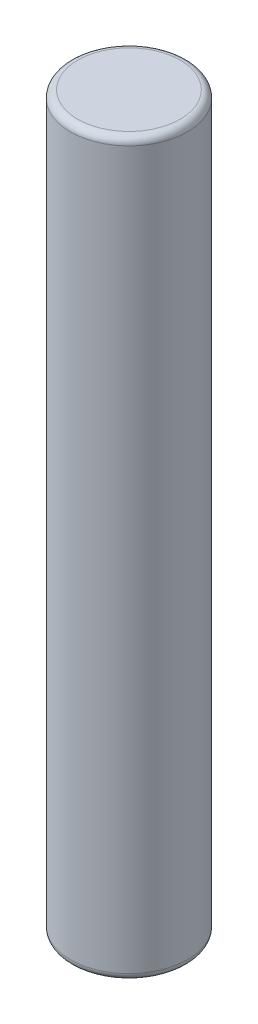
ISO-10303-21;
HEADER;
FILE_DESCRIPTION(('STEP AP214'),'2;1');
FILE_NAME('part.step','',(''),(''),'','','');
FILE_SCHEMA(('AUTOMOTIVE_DESIGN { 1 0 10303 214 1 1 1 1 }'));
ENDSEC;
DATA;
#1=APPLICATION_CONTEXT('core data for automotive mechanical design processes');
#2=APPLICATION_PROTOCOL_DEFINITION('international standard','automotive_design',2000,#1);
#3=PRODUCT_CONTEXT('',#1,'mechanical');
#4=PRODUCT('Part','Part','',(#3));
#5=PRODUCT_RELATED_PRODUCT_CATEGORY('part','',(#4));
#6=PRODUCT_DEFINITION_FORMATION('','',#4);
#7=PRODUCT_DEFINITION_CONTEXT('part definition',#1,'design');
#8=PRODUCT_DEFINITION('design','',#6,#7);
#9=PRODUCT_DEFINITION_SHAPE('','',#8);
#10=(LENGTH_UNIT() NAMED_UNIT(*) SI_UNIT(.MILLI.,.METRE.));
#11=(NAMED_UNIT(*) PLANE_ANGLE_UNIT() SI_UNIT($,.RADIAN.));
#12=(NAMED_UNIT(*) SI_UNIT($,.STERADIAN.) SOLID_ANGLE_UNIT());
#13=UNCERTAINTY_MEASURE_WITH_UNIT(LENGTH_MEASURE(1.E-05),#10,'distance_accuracy_value','');
#14=(GEOMETRIC_REPRESENTATION_CONTEXT(3) GLOBAL_UNCERTAINTY_ASSIGNED_CONTEXT((#13)) GLOBAL_UNIT_ASSIGNED_CONTEXT((#10,
#11,#12)) REPRESENTATION_CONTEXT('',''));
#15=CARTESIAN_POINT('',(0.,0.,0.));
#16=DIRECTION('',(0.,0.,1.));
#17=DIRECTION('',(1.,0.,0.));
#18=AXIS2_PLACEMENT_3D('',#15,#16,#17);
#19=CARTESIAN_POINT('',(0.,50.,0.));
#20=DIRECTION('',(0.,-1.,0.));
#21=DIRECTION('',(0.,0.,-1.));
#22=AXIS2_PLACEMENT_3D('',#19,#20,#21);
#23=CYLINDRICAL_SURFACE('',#22,4.);
#24=CARTESIAN_POINT('',(0.,49.5,0.));
#25=DIRECTION('',(0.,1.,0.));
#26=DIRECTION('',(0.,0.,1.));
#27=AXIS2_PLACEMENT_3D('',#24,#25,#26);
#28=CIRCLE('',#27,4.);
#29=CARTESIAN_POINT('',(0.,49.5,4.));
#30=VERTEX_POINT('',#29);
#31=EDGE_CURVE('E41',#30,#30,#28,.F.);
#32=ORIENTED_EDGE('',*,*,#31,.T.);
#33=EDGE_LOOP('',(#32));
#34=FACE_BOUND('',#33,.T.);
#35=CARTESIAN_POINT('',(0.,0.5,0.));
#36=DIRECTION('',(0.,1.,0.));
#37=DIRECTION('',(0.,0.,1.));
#38=AXIS2_PLACEMENT_3D('',#35,#36,#37);
#39=CIRCLE('',#38,4.);
#40=CARTESIAN_POINT('',(0.,0.5,4.));
#41=VERTEX_POINT('',#40);
#42=EDGE_CURVE('E46',#41,#41,#39,.T.);
#43=ORIENTED_EDGE('',*,*,#42,.T.);
#44=EDGE_LOOP('',(#43));
#45=FACE_BOUND('',#44,.T.);
#46=ADVANCED_FACE('F34',(#34,#45),#23,.T.);
#47=CARTESIAN_POINT('',(0.,50.,0.));
#48=DIRECTION('',(0.,1.,0.));
#49=DIRECTION('',(0.,0.,1.));
#50=AXIS2_PLACEMENT_3D('',#47,#48,#49);
#51=PLANE('',#50);
#52=CARTESIAN_POINT('',(0.,50.,0.));
#53=DIRECTION('',(0.,1.,0.));
#54=DIRECTION('',(0.,0.,1.));
#55=AXIS2_PLACEMENT_3D('',#52,#53,#54);
#56=CIRCLE('',#55,3.5);
#57=CARTESIAN_POINT('',(0.,50.,3.5));
#58=VERTEX_POINT('',#57);
#59=EDGE_CURVE('E51',#58,#58,#56,.T.);
#60=ORIENTED_EDGE('',*,*,#59,.T.);
#61=EDGE_LOOP('',(#60));
#62=FACE_BOUND('',#61,.T.);
#63=ADVANCED_FACE('F57',(#62),#51,.T.);
#64=CARTESIAN_POINT('',(0.,0.,0.));
#65=DIRECTION('',(0.,1.,0.));
#66=DIRECTION('',(0.,0.,1.));
#67=AXIS2_PLACEMENT_3D('',#64,#65,#66);
#68=PLANE('',#67);
#69=CARTESIAN_POINT('',(0.,0.,0.));
#70=DIRECTION('',(0.,1.,0.));
#71=DIRECTION('',(0.,0.,1.));
#72=AXIS2_PLACEMENT_3D('',#69,#70,#71);
#73=CIRCLE('',#72,3.5);
#74=CARTESIAN_POINT('',(0.,0.,3.5));
#75=VERTEX_POINT('',#74);
#76=EDGE_CURVE('E10',#75,#75,#73,.F.);
#77=ORIENTED_EDGE('',*,*,#76,.T.);
#78=EDGE_LOOP('',(#77));
#79=FACE_BOUND('',#78,.T.);
#80=ADVANCED_FACE('F61',(#79),#68,.F.);
#81=CARTESIAN_POINT('',(0.,49.5,0.));
#82=DIRECTION('',(0.,1.,0.));
#83=DIRECTION('',(0.,0.,1.));
#84=AXIS2_PLACEMENT_3D('',#81,#82,#83);
#85=TOROIDAL_SURFACE('',#84,3.5,0.5);
#86=ORIENTED_EDGE('',*,*,#31,.F.);
#87=EDGE_LOOP('',(#86));
#88=FACE_BOUND('',#87,.T.);
#89=ORIENTED_EDGE('',*,*,#59,.F.);
#90=EDGE_LOOP('',(#89));
#91=FACE_BOUND('',#90,.T.);
#92=ADVANCED_FACE('F59',(#88,#91),#85,.T.);
#93=CARTESIAN_POINT('',(0.,0.5,0.));
#94=DIRECTION('',(0.,1.,0.));
#95=DIRECTION('',(0.,0.,1.));
#96=AXIS2_PLACEMENT_3D('',#93,#94,#95);
#97=TOROIDAL_SURFACE('',#96,3.5,0.5);
#98=ORIENTED_EDGE('',*,*,#76,.F.);
#99=EDGE_LOOP('',(#98));
#100=FACE_BOUND('',#99,.T.);
#101=ORIENTED_EDGE('',*,*,#42,.F.);
#102=EDGE_LOOP('',(#101));
#103=FACE_BOUND('',#102,.T.);
#104=ADVANCED_FACE('F36',(#100,#103),#97,.T.);
#105=CLOSED_SHELL('',(#46,#63,#80,#92,#104));
#106=MANIFOLD_SOLID_BREP('B2',#105);
#107=ADVANCED_BREP_SHAPE_REPRESENTATION('',(#18,#106),#14);
#108=SHAPE_DEFINITION_REPRESENTATION(#9,#107);
ENDSEC;
END-ISO-10303-21;
